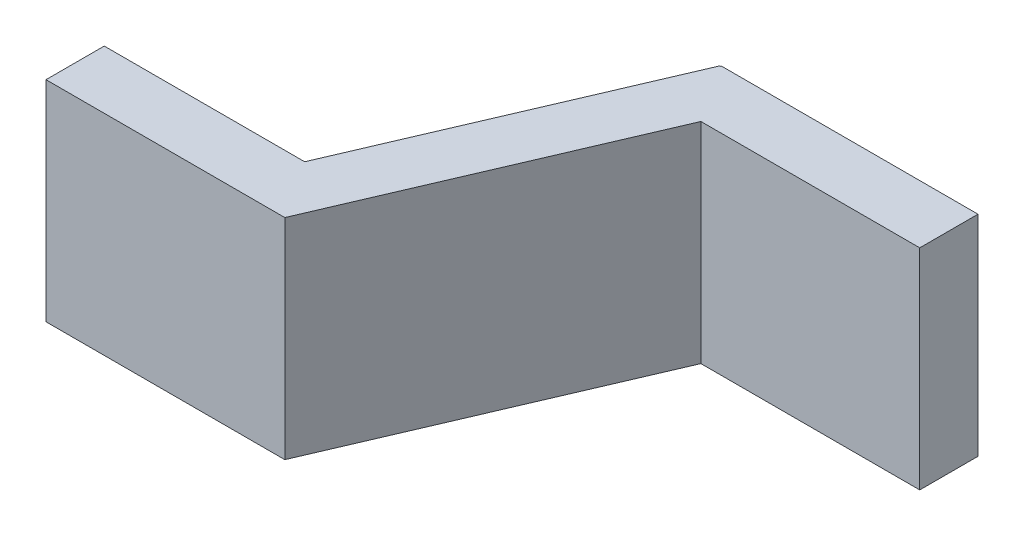
ISO-10303-21;
HEADER;
FILE_DESCRIPTION(('STEP AP214'),'2;1');
FILE_NAME('part.step','',(''),(''),'','','');
FILE_SCHEMA(('AUTOMOTIVE_DESIGN { 1 0 10303 214 1 1 1 1 }'));
ENDSEC;
DATA;
#1=APPLICATION_CONTEXT('core data for automotive mechanical design processes');
#2=APPLICATION_PROTOCOL_DEFINITION('international standard','automotive_design',2000,#1);
#3=PRODUCT_CONTEXT('',#1,'mechanical');
#4=PRODUCT('Part','Part','',(#3));
#5=PRODUCT_RELATED_PRODUCT_CATEGORY('part','',(#4));
#6=PRODUCT_DEFINITION_FORMATION('','',#4);
#7=PRODUCT_DEFINITION_CONTEXT('part definition',#1,'design');
#8=PRODUCT_DEFINITION('design','',#6,#7);
#9=PRODUCT_DEFINITION_SHAPE('','',#8);
#10=(LENGTH_UNIT() NAMED_UNIT(*) SI_UNIT(.MILLI.,.METRE.));
#11=(NAMED_UNIT(*) PLANE_ANGLE_UNIT() SI_UNIT($,.RADIAN.));
#12=(NAMED_UNIT(*) SI_UNIT($,.STERADIAN.) SOLID_ANGLE_UNIT());
#13=UNCERTAINTY_MEASURE_WITH_UNIT(LENGTH_MEASURE(1.E-05),#10,'distance_accuracy_value','');
#14=(GEOMETRIC_REPRESENTATION_CONTEXT(3) GLOBAL_UNCERTAINTY_ASSIGNED_CONTEXT((#13)) GLOBAL_UNIT_ASSIGNED_CONTEXT((#10,
#11,#12)) REPRESENTATION_CONTEXT('',''));
#15=CARTESIAN_POINT('',(0.,0.,0.));
#16=DIRECTION('',(0.,0.,1.));
#17=DIRECTION('',(1.,0.,0.));
#18=AXIS2_PLACEMENT_3D('',#15,#16,#17);
#19=CARTESIAN_POINT('',(11.558086453539,4.22,0.0006058345056003));
#20=DIRECTION('',(-0.919135450912914,0.,-0.393941649073963));
#21=DIRECTION('',(-0.393941649073963,0.,0.919135450912914));
#22=AXIS2_PLACEMENT_3D('',#19,#20,#21);
#23=PLANE('',#22);
#24=DIRECTION('',(0.,1.,0.));
#25=VECTOR('',#24,1.);
#26=CARTESIAN_POINT('',(11.344046008361,4.22,0.5));
#27=LINE('',#26,#25);
#28=CARTESIAN_POINT('',(11.344046008361,4.22,0.5));
#29=VERTEX_POINT('',#28);
#30=CARTESIAN_POINT('',(11.344046008361,4.580000014305,0.5));
#31=VERTEX_POINT('',#30);
#32=EDGE_CURVE('E94',#29,#31,#27,.T.);
#33=ORIENTED_EDGE('',*,*,#32,.T.);
#34=DIRECTION('',(-0.393941649073123,0.,0.919135450913275));
#35=VECTOR('',#34,1.);
#36=CARTESIAN_POINT('',(11.558086453539,4.580000014305,0.000605834505600302));
#37=LINE('',#36,#35);
#38=CARTESIAN_POINT('',(11.558086453539,4.580000014305,0.000605834505577237));
#39=VERTEX_POINT('',#38);
#40=EDGE_CURVE('E121',#39,#31,#37,.T.);
#41=ORIENTED_EDGE('',*,*,#40,.F.);
#42=DIRECTION('',(0.,1.,0.));
#43=VECTOR('',#42,1.);
#44=CARTESIAN_POINT('',(11.558086453539,4.22,0.000605834505554305));
#45=LINE('',#44,#43);
#46=CARTESIAN_POINT('',(11.558086453539,4.22,0.000605834505584969));
#47=VERTEX_POINT('',#46);
#48=EDGE_CURVE('E110',#39,#47,#45,.F.);
#49=ORIENTED_EDGE('',*,*,#48,.T.);
#50=DIRECTION('',(-0.393941649073123,0.,0.919135450913275));
#51=VECTOR('',#50,1.);
#52=CARTESIAN_POINT('',(11.558086453539,4.22,0.000605834505600302));
#53=LINE('',#52,#51);
#54=EDGE_CURVE('E100',#47,#29,#53,.T.);
#55=ORIENTED_EDGE('',*,*,#54,.T.);
#56=EDGE_LOOP('',(#33,#41,#49,#55));
#57=FACE_BOUND('',#56,.T.);
#58=ADVANCED_FACE('F17',(#57),#23,.T.);
#59=CARTESIAN_POINT('',(11.,4.22,0.5));
#60=DIRECTION('',(0.,0.,1.));
#61=DIRECTION('',(1.,0.,0.));
#62=AXIS2_PLACEMENT_3D('',#59,#60,#61);
#63=PLANE('',#62);
#64=DIRECTION('',(1.,0.,0.));
#65=VECTOR('',#64,1.);
#66=CARTESIAN_POINT('',(11.65,4.580000014305,0.5));
#67=LINE('',#66,#65);
#68=CARTESIAN_POINT('',(11.,4.580000014305,0.5));
#69=VERTEX_POINT('',#68);
#70=EDGE_CURVE('E79',#31,#69,#67,.F.);
#71=ORIENTED_EDGE('',*,*,#70,.F.);
#72=ORIENTED_EDGE('',*,*,#32,.F.);
#73=DIRECTION('',(1.,0.,0.));
#74=VECTOR('',#73,1.);
#75=CARTESIAN_POINT('',(11.65,4.22,0.5));
#76=LINE('',#75,#74);
#77=CARTESIAN_POINT('',(11.,4.22,0.5));
#78=VERTEX_POINT('',#77);
#79=EDGE_CURVE('E169',#29,#78,#76,.F.);
#80=ORIENTED_EDGE('',*,*,#79,.T.);
#81=DIRECTION('',(0.,1.,0.));
#82=VECTOR('',#81,1.);
#83=CARTESIAN_POINT('',(11.,4.22,0.5));
#84=LINE('',#83,#82);
#85=EDGE_CURVE('E87',#78,#69,#84,.T.);
#86=ORIENTED_EDGE('',*,*,#85,.T.);
#87=EDGE_LOOP('',(#71,#72,#80,#86));
#88=FACE_BOUND('',#87,.T.);
#89=ADVANCED_FACE('F198',(#88),#63,.F.);
#90=CARTESIAN_POINT('',(11.,4.22,0.5));
#91=DIRECTION('',(1.,0.,0.));
#92=DIRECTION('',(0.,0.,-1.));
#93=AXIS2_PLACEMENT_3D('',#90,#91,#92);
#94=PLANE('',#93);
#95=ORIENTED_EDGE('',*,*,#85,.F.);
#96=DIRECTION('',(0.,0.,1.));
#97=VECTOR('',#96,1.);
#98=CARTESIAN_POINT('',(11.,4.22,0.04));
#99=LINE('',#98,#97);
#100=CARTESIAN_POINT('',(11.,4.22,0.60000000149));
#101=VERTEX_POINT('',#100);
#102=EDGE_CURVE('E153',#78,#101,#99,.T.);
#103=ORIENTED_EDGE('',*,*,#102,.T.);
#104=DIRECTION('',(0.,1.,0.));
#105=VECTOR('',#104,1.);
#106=CARTESIAN_POINT('',(11.,4.22,0.60000000149));
#107=LINE('',#106,#105);
#108=CARTESIAN_POINT('',(11.,4.580000014305,0.60000000149));
#109=VERTEX_POINT('',#108);
#110=EDGE_CURVE('E117',#109,#101,#107,.F.);
#111=ORIENTED_EDGE('',*,*,#110,.F.);
#112=DIRECTION('',(0.,0.,1.));
#113=VECTOR('',#112,1.);
#114=CARTESIAN_POINT('',(11.,4.580000014305,0.04));
#115=LINE('',#114,#113);
#116=EDGE_CURVE('E71',#69,#109,#115,.T.);
#117=ORIENTED_EDGE('',*,*,#116,.F.);
#118=EDGE_LOOP('',(#95,#103,#111,#117));
#119=FACE_BOUND('',#118,.T.);
#120=ADVANCED_FACE('F202',(#119),#94,.F.);
#121=CARTESIAN_POINT('',(11.999999997616,4.22,0.));
#122=DIRECTION('',(1.,0.,0.));
#123=DIRECTION('',(0.,0.,-1.));
#124=AXIS2_PLACEMENT_3D('',#121,#122,#123);
#125=PLANE('',#124);
#126=DIRECTION('',(0.,0.,1.));
#127=VECTOR('',#126,1.);
#128=CARTESIAN_POINT('',(11.999999997616,4.22,0.04));
#129=LINE('',#128,#127);
#130=CARTESIAN_POINT('',(11.999999997616,4.22,0.10000000149));
#131=VERTEX_POINT('',#130);
#132=CARTESIAN_POINT('',(11.999999997616,4.22,0.));
#133=VERTEX_POINT('',#132);
#134=EDGE_CURVE('E179',#131,#133,#129,.F.);
#135=ORIENTED_EDGE('',*,*,#134,.T.);
#136=DIRECTION('',(0.,1.,0.));
#137=VECTOR('',#136,1.);
#138=CARTESIAN_POINT('',(11.999999997616,4.22,0.));
#139=LINE('',#138,#137);
#140=CARTESIAN_POINT('',(11.999999997616,4.580000014305,0.));
#141=VERTEX_POINT('',#140);
#142=EDGE_CURVE('E174',#133,#141,#139,.T.);
#143=ORIENTED_EDGE('',*,*,#142,.T.);
#144=DIRECTION('',(0.,0.,1.));
#145=VECTOR('',#144,1.);
#146=CARTESIAN_POINT('',(11.999999997616,4.580000014305,0.04));
#147=LINE('',#146,#145);
#148=CARTESIAN_POINT('',(11.999999997616,4.580000014305,0.10000000149));
#149=VERTEX_POINT('',#148);
#150=EDGE_CURVE('E155',#149,#141,#147,.F.);
#151=ORIENTED_EDGE('',*,*,#150,.F.);
#152=DIRECTION('',(0.,1.,0.));
#153=VECTOR('',#152,1.);
#154=CARTESIAN_POINT('',(11.999999997616,4.22,0.10000000149));
#155=LINE('',#154,#153);
#156=EDGE_CURVE('E125',#131,#149,#155,.T.);
#157=ORIENTED_EDGE('',*,*,#156,.F.);
#158=EDGE_LOOP('',(#135,#143,#151,#157));
#159=FACE_BOUND('',#158,.T.);
#160=ADVANCED_FACE('F228',(#159),#125,.T.);
#161=CARTESIAN_POINT('',(11.56,4.22,0.));
#162=DIRECTION('',(0.,0.,1.));
#163=DIRECTION('',(1.,0.,0.));
#164=AXIS2_PLACEMENT_3D('',#161,#162,#163);
#165=PLANE('',#164);
#166=DIRECTION('',(1.,0.,0.));
#167=VECTOR('',#166,1.);
#168=CARTESIAN_POINT('',(11.65,4.22,0.));
#169=LINE('',#168,#167);
#170=CARTESIAN_POINT('',(11.56,4.22,0.));
#171=VERTEX_POINT('',#170);
#172=EDGE_CURVE('E150',#133,#171,#169,.F.);
#173=ORIENTED_EDGE('',*,*,#172,.T.);
#174=DIRECTION('',(0.,1.,0.));
#175=VECTOR('',#174,1.);
#176=CARTESIAN_POINT('',(11.56,4.22,0.));
#177=LINE('',#176,#175);
#178=CARTESIAN_POINT('',(11.56,4.580000014305,0.));
#179=VERTEX_POINT('',#178);
#180=EDGE_CURVE('E164',#171,#179,#177,.T.);
#181=ORIENTED_EDGE('',*,*,#180,.T.);
#182=DIRECTION('',(1.,0.,0.));
#183=VECTOR('',#182,1.);
#184=CARTESIAN_POINT('',(11.65,4.580000014305,0.));
#185=LINE('',#184,#183);
#186=EDGE_CURVE('E154',#141,#179,#185,.F.);
#187=ORIENTED_EDGE('',*,*,#186,.F.);
#188=ORIENTED_EDGE('',*,*,#142,.F.);
#189=EDGE_LOOP('',(#173,#181,#187,#188));
#190=FACE_BOUND('',#189,.T.);
#191=ADVANCED_FACE('F232',(#190),#165,.F.);
#192=CARTESIAN_POINT('',(11.56,4.22,0.));
#193=DIRECTION('',(1.,0.,0.));
#194=DIRECTION('',(0.,0.,-1.));
#195=AXIS2_PLACEMENT_3D('',#192,#193,#194);
#196=PLANE('',#195);
#197=DIRECTION('',(0.,1.,0.));
#198=VECTOR('',#197,1.);
#199=CARTESIAN_POINT('',(11.56,4.22,0.00142598092431268));
#200=LINE('',#199,#198);
#201=CARTESIAN_POINT('',(11.56,4.22,0.00142598092431734));
#202=VERTEX_POINT('',#201);
#203=CARTESIAN_POINT('',(11.56,4.580000014305,0.00142598092431734));
#204=VERTEX_POINT('',#203);
#205=EDGE_CURVE('E118',#202,#204,#200,.T.);
#206=ORIENTED_EDGE('',*,*,#205,.T.);
#207=DIRECTION('',(0.,0.,1.));
#208=VECTOR('',#207,1.);
#209=CARTESIAN_POINT('',(11.56,4.580000014305,0.04));
#210=LINE('',#209,#208);
#211=EDGE_CURVE('E123',#179,#204,#210,.T.);
#212=ORIENTED_EDGE('',*,*,#211,.F.);
#213=ORIENTED_EDGE('',*,*,#180,.F.);
#214=DIRECTION('',(0.,0.,-1.));
#215=VECTOR('',#214,1.);
#216=CARTESIAN_POINT('',(11.56,4.22,0.));
#217=LINE('',#216,#215);
#218=EDGE_CURVE('E147',#171,#202,#217,.F.);
#219=ORIENTED_EDGE('',*,*,#218,.T.);
#220=EDGE_LOOP('',(#206,#212,#213,#219));
#221=FACE_BOUND('',#220,.T.);
#222=ADVANCED_FACE('F234',(#221),#196,.F.);
#223=CARTESIAN_POINT('',(11.65,4.22,0.04));
#224=DIRECTION('',(-0.393941649073963,0.,0.919135450912914));
#225=DIRECTION('',(0.919135450912914,0.,0.393941649073963));
#226=AXIS2_PLACEMENT_3D('',#223,#224,#225);
#227=PLANE('',#226);
#228=DIRECTION('',(-0.919135450920459,0.,-0.393941649056361));
#229=VECTOR('',#228,1.);
#230=CARTESIAN_POINT('',(11.56,4.580000014305,0.001425980924322));
#231=LINE('',#230,#229);
#232=EDGE_CURVE('E113',#204,#39,#231,.T.);
#233=ORIENTED_EDGE('',*,*,#232,.F.);
#234=ORIENTED_EDGE('',*,*,#205,.F.);
#235=DIRECTION('',(-0.919135450920459,0.,-0.393941649056361));
#236=VECTOR('',#235,1.);
#237=CARTESIAN_POINT('',(11.56,4.22,0.001425980924322));
#238=LINE('',#237,#236);
#239=EDGE_CURVE('E114',#202,#47,#238,.T.);
#240=ORIENTED_EDGE('',*,*,#239,.T.);
#241=ORIENTED_EDGE('',*,*,#48,.F.);
#242=EDGE_LOOP('',(#233,#234,#240,#241));
#243=FACE_BOUND('',#242,.T.);
#244=ADVANCED_FACE('F112',(#243),#227,.F.);
#245=CARTESIAN_POINT('',(11.,4.22,0.60000000149));
#246=DIRECTION('',(0.,0.,1.));
#247=DIRECTION('',(1.,0.,0.));
#248=AXIS2_PLACEMENT_3D('',#245,#246,#247);
#249=PLANE('',#248);
#250=DIRECTION('',(0.,1.,0.));
#251=VECTOR('',#250,1.);
#252=CARTESIAN_POINT('',(11.4099838806682,4.22,0.60000000149));
#253=LINE('',#252,#251);
#254=CARTESIAN_POINT('',(11.4099838806682,4.22,0.60000000149));
#255=VERTEX_POINT('',#254);
#256=CARTESIAN_POINT('',(11.4099838806682,4.580000014305,0.60000000149));
#257=VERTEX_POINT('',#256);
#258=EDGE_CURVE('E144',#255,#257,#253,.T.);
#259=ORIENTED_EDGE('',*,*,#258,.T.);
#260=DIRECTION('',(1.,0.,0.));
#261=VECTOR('',#260,1.);
#262=CARTESIAN_POINT('',(11.65,4.580000014305,0.60000000149));
#263=LINE('',#262,#261);
#264=EDGE_CURVE('E20',#109,#257,#263,.T.);
#265=ORIENTED_EDGE('',*,*,#264,.F.);
#266=ORIENTED_EDGE('',*,*,#110,.T.);
#267=DIRECTION('',(1.,0.,0.));
#268=VECTOR('',#267,1.);
#269=CARTESIAN_POINT('',(11.,4.22,0.60000000149));
#270=LINE('',#269,#268);
#271=EDGE_CURVE('E151',#101,#255,#270,.T.);
#272=ORIENTED_EDGE('',*,*,#271,.T.);
#273=EDGE_LOOP('',(#259,#265,#266,#272));
#274=FACE_BOUND('',#273,.T.);
#275=ADVANCED_FACE('F205',(#274),#249,.T.);
#276=CARTESIAN_POINT('',(11.65,4.580000014305,0.04));
#277=DIRECTION('',(0.,1.,0.));
#278=DIRECTION('',(0.,0.,1.));
#279=AXIS2_PLACEMENT_3D('',#276,#277,#278);
#280=PLANE('',#279);
#281=ORIENTED_EDGE('',*,*,#211,.T.);
#282=ORIENTED_EDGE('',*,*,#232,.T.);
#283=ORIENTED_EDGE('',*,*,#40,.T.);
#284=ORIENTED_EDGE('',*,*,#70,.T.);
#285=ORIENTED_EDGE('',*,*,#116,.T.);
#286=ORIENTED_EDGE('',*,*,#264,.T.);
#287=DIRECTION('',(-0.393941649073964,0.,0.919135450912914));
#288=VECTOR('',#287,1.);
#289=CARTESIAN_POINT('',(11.6242839866442,4.580000014305,0.100000001490094));
#290=LINE('',#289,#288);
#291=CARTESIAN_POINT('',(11.6242839866442,4.580000014305,0.100000001490047));
#292=VERTEX_POINT('',#291);
#293=EDGE_CURVE('E141',#257,#292,#290,.F.);
#294=ORIENTED_EDGE('',*,*,#293,.T.);
#295=DIRECTION('',(1.,0.,0.));
#296=VECTOR('',#295,1.);
#297=CARTESIAN_POINT('',(11.56,4.580000014305,0.10000000149));
#298=LINE('',#297,#296);
#299=EDGE_CURVE('E170',#149,#292,#298,.F.);
#300=ORIENTED_EDGE('',*,*,#299,.F.);
#301=ORIENTED_EDGE('',*,*,#150,.T.);
#302=ORIENTED_EDGE('',*,*,#186,.T.);
#303=EDGE_LOOP('',(#281,#282,#283,#284,#285,#286,#294,#300,#301,#302));
#304=FACE_BOUND('',#303,.T.);
#305=ADVANCED_FACE('F120',(#304),#280,.T.);
#306=CARTESIAN_POINT('',(11.56,4.22,0.10000000149));
#307=DIRECTION('',(0.,0.,1.));
#308=DIRECTION('',(1.,0.,0.));
#309=AXIS2_PLACEMENT_3D('',#306,#307,#308);
#310=PLANE('',#309);
#311=ORIENTED_EDGE('',*,*,#299,.T.);
#312=DIRECTION('',(0.,1.,0.));
#313=VECTOR('',#312,1.);
#314=CARTESIAN_POINT('',(11.6242839866442,4.22,0.100000001490094));
#315=LINE('',#314,#313);
#316=CARTESIAN_POINT('',(11.6242839866442,4.22,0.100000001490047));
#317=VERTEX_POINT('',#316);
#318=EDGE_CURVE('E26',#292,#317,#315,.F.);
#319=ORIENTED_EDGE('',*,*,#318,.T.);
#320=DIRECTION('',(1.,0.,0.));
#321=VECTOR('',#320,1.);
#322=CARTESIAN_POINT('',(11.65,4.22,0.10000000149));
#323=LINE('',#322,#321);
#324=EDGE_CURVE('E34',#317,#131,#323,.T.);
#325=ORIENTED_EDGE('',*,*,#324,.T.);
#326=ORIENTED_EDGE('',*,*,#156,.T.);
#327=EDGE_LOOP('',(#311,#319,#325,#326));
#328=FACE_BOUND('',#327,.T.);
#329=ADVANCED_FACE('F223',(#328),#310,.T.);
#330=CARTESIAN_POINT('',(11.65,4.22,0.04));
#331=DIRECTION('',(0.,1.,0.));
#332=DIRECTION('',(0.,0.,1.));
#333=AXIS2_PLACEMENT_3D('',#330,#331,#332);
#334=PLANE('',#333);
#335=ORIENTED_EDGE('',*,*,#218,.F.);
#336=ORIENTED_EDGE('',*,*,#172,.F.);
#337=ORIENTED_EDGE('',*,*,#134,.F.);
#338=ORIENTED_EDGE('',*,*,#324,.F.);
#339=DIRECTION('',(0.393941649073964,0.,-0.919135450912914));
#340=VECTOR('',#339,1.);
#341=CARTESIAN_POINT('',(11.4098164411035,4.22,0.600390667570103));
#342=LINE('',#341,#340);
#343=EDGE_CURVE('E11',#317,#255,#342,.F.);
#344=ORIENTED_EDGE('',*,*,#343,.T.);
#345=ORIENTED_EDGE('',*,*,#271,.F.);
#346=ORIENTED_EDGE('',*,*,#102,.F.);
#347=ORIENTED_EDGE('',*,*,#79,.F.);
#348=ORIENTED_EDGE('',*,*,#54,.F.);
#349=ORIENTED_EDGE('',*,*,#239,.F.);
#350=EDGE_LOOP('',(#335,#336,#337,#338,#344,#345,#346,#347,#348,#349));
#351=FACE_BOUND('',#350,.T.);
#352=ADVANCED_FACE('F200',(#351),#334,.F.);
#353=CARTESIAN_POINT('',(11.65,4.22,0.04));
#354=DIRECTION('',(-0.919135450912914,0.,-0.393941649073963));
#355=DIRECTION('',(-0.393941649073963,0.,0.919135450912914));
#356=AXIS2_PLACEMENT_3D('',#353,#354,#355);
#357=PLANE('',#356);
#358=ORIENTED_EDGE('',*,*,#318,.F.);
#359=ORIENTED_EDGE('',*,*,#293,.F.);
#360=ORIENTED_EDGE('',*,*,#258,.F.);
#361=ORIENTED_EDGE('',*,*,#343,.F.);
#362=EDGE_LOOP('',(#358,#359,#360,#361));
#363=FACE_BOUND('',#362,.T.);
#364=ADVANCED_FACE('F210',(#363),#357,.F.);
#365=CLOSED_SHELL('',(#58,#89,#120,#160,#191,#222,#244,#275,#305,#329,#352,#364));
#366=MANIFOLD_SOLID_BREP('B1',#365);
#367=ADVANCED_BREP_SHAPE_REPRESENTATION('',(#18,#366),#14);
#368=SHAPE_DEFINITION_REPRESENTATION(#9,#367);
ENDSEC;
END-ISO-10303-21;
